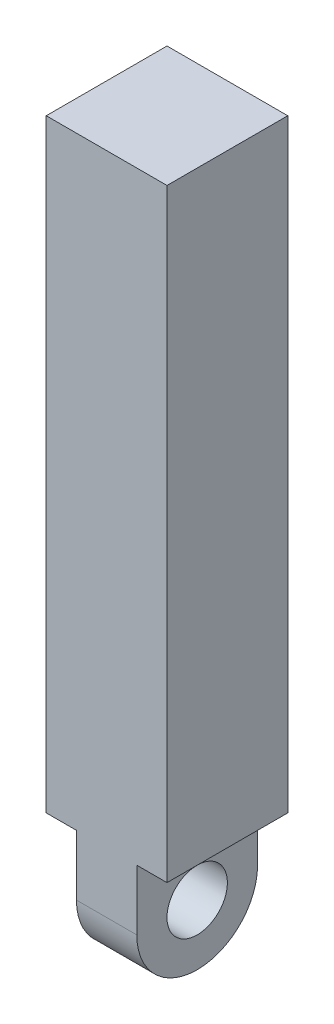
ISO-10303-21;
HEADER;
FILE_DESCRIPTION(('STEP AP214'),'2;1');
FILE_NAME('part.step','',(''),(''),'','','');
FILE_SCHEMA(('AUTOMOTIVE_DESIGN { 1 0 10303 214 1 1 1 1 }'));
ENDSEC;
DATA;
#1=APPLICATION_CONTEXT('core data for automotive mechanical design processes');
#2=APPLICATION_PROTOCOL_DEFINITION('international standard','automotive_design',2000,#1);
#3=PRODUCT_CONTEXT('',#1,'mechanical');
#4=PRODUCT('Part','Part','',(#3));
#5=PRODUCT_RELATED_PRODUCT_CATEGORY('part','',(#4));
#6=PRODUCT_DEFINITION_FORMATION('','',#4);
#7=PRODUCT_DEFINITION_CONTEXT('part definition',#1,'design');
#8=PRODUCT_DEFINITION('design','',#6,#7);
#9=PRODUCT_DEFINITION_SHAPE('','',#8);
#10=(LENGTH_UNIT() NAMED_UNIT(*) SI_UNIT(.MILLI.,.METRE.));
#11=(NAMED_UNIT(*) PLANE_ANGLE_UNIT() SI_UNIT($,.RADIAN.));
#12=(NAMED_UNIT(*) SI_UNIT($,.STERADIAN.) SOLID_ANGLE_UNIT());
#13=UNCERTAINTY_MEASURE_WITH_UNIT(LENGTH_MEASURE(1.E-05),#10,'distance_accuracy_value','');
#14=(GEOMETRIC_REPRESENTATION_CONTEXT(3) GLOBAL_UNCERTAINTY_ASSIGNED_CONTEXT((#13)) GLOBAL_UNIT_ASSIGNED_CONTEXT((#10,
#11,#12)) REPRESENTATION_CONTEXT('',''));
#15=CARTESIAN_POINT('',(0.,0.,0.));
#16=DIRECTION('',(0.,0.,1.));
#17=DIRECTION('',(1.,0.,0.));
#18=AXIS2_PLACEMENT_3D('',#15,#16,#17);
#19=CARTESIAN_POINT('',(50.8,609.6,50.8));
#20=DIRECTION('',(-1.,0.,0.));
#21=DIRECTION('',(0.,0.,1.));
#22=AXIS2_PLACEMENT_3D('',#19,#20,#21);
#23=PLANE('',#22);
#24=DIRECTION('',(0.,-1.,0.));
#25=VECTOR('',#24,1.);
#26=CARTESIAN_POINT('',(50.8,609.6,50.8));
#27=LINE('',#26,#25);
#28=CARTESIAN_POINT('',(50.8,609.6,50.8));
#29=VERTEX_POINT('',#28);
#30=CARTESIAN_POINT('',(50.8,101.6,50.8));
#31=VERTEX_POINT('',#30);
#32=EDGE_CURVE('E164',#29,#31,#27,.T.);
#33=ORIENTED_EDGE('',*,*,#32,.T.);
#34=DIRECTION('',(0.,0.,1.));
#35=VECTOR('',#34,1.);
#36=CARTESIAN_POINT('',(50.8,101.6,-50.8));
#37=LINE('',#36,#35);
#38=CARTESIAN_POINT('',(50.8,101.6,-50.8));
#39=VERTEX_POINT('',#38);
#40=EDGE_CURVE('E143',#39,#31,#37,.T.);
#41=ORIENTED_EDGE('',*,*,#40,.F.);
#42=DIRECTION('',(0.,-1.,0.));
#43=VECTOR('',#42,1.);
#44=CARTESIAN_POINT('',(50.8,609.6,-50.8));
#45=LINE('',#44,#43);
#46=CARTESIAN_POINT('',(50.8,609.6,-50.8));
#47=VERTEX_POINT('',#46);
#48=EDGE_CURVE('E172',#47,#39,#45,.T.);
#49=ORIENTED_EDGE('',*,*,#48,.F.);
#50=DIRECTION('',(0.,0.,-1.));
#51=VECTOR('',#50,1.);
#52=CARTESIAN_POINT('',(50.8,609.6,50.8));
#53=LINE('',#52,#51);
#54=EDGE_CURVE('E141',#29,#47,#53,.T.);
#55=ORIENTED_EDGE('',*,*,#54,.F.);
#56=EDGE_LOOP('',(#33,#41,#49,#55));
#57=FACE_BOUND('',#56,.T.);
#58=ADVANCED_FACE('F39',(#57),#23,.F.);
#59=CARTESIAN_POINT('',(-50.8,609.6,-50.8));
#60=DIRECTION('',(0.,0.,1.));
#61=DIRECTION('',(1.,0.,0.));
#62=AXIS2_PLACEMENT_3D('',#59,#60,#61);
#63=PLANE('',#62);
#64=DIRECTION('',(0.,-1.,0.));
#65=VECTOR('',#64,1.);
#66=CARTESIAN_POINT('',(25.4,0.,-50.8));
#67=LINE('',#66,#65);
#68=CARTESIAN_POINT('',(25.4,101.6,-50.8));
#69=VERTEX_POINT('',#68);
#70=CARTESIAN_POINT('',(25.4,50.8,-50.8));
#71=VERTEX_POINT('',#70);
#72=EDGE_CURVE('E145',#69,#71,#67,.T.);
#73=ORIENTED_EDGE('',*,*,#72,.T.);
#74=DIRECTION('',(-1.,0.,0.));
#75=VECTOR('',#74,1.);
#76=CARTESIAN_POINT('',(-25.4,50.8,-50.8));
#77=LINE('',#76,#75);
#78=CARTESIAN_POINT('',(-25.4,50.8,-50.8));
#79=VERTEX_POINT('',#78);
#80=EDGE_CURVE('E121',#71,#79,#77,.T.);
#81=ORIENTED_EDGE('',*,*,#80,.T.);
#82=DIRECTION('',(0.,1.,0.));
#83=VECTOR('',#82,1.);
#84=CARTESIAN_POINT('',(-25.4,0.,-50.8));
#85=LINE('',#84,#83);
#86=CARTESIAN_POINT('',(-25.4,101.6,-50.8));
#87=VERTEX_POINT('',#86);
#88=EDGE_CURVE('E112',#79,#87,#85,.T.);
#89=ORIENTED_EDGE('',*,*,#88,.T.);
#90=DIRECTION('',(-1.,0.,0.));
#91=VECTOR('',#90,1.);
#92=CARTESIAN_POINT('',(-50.8,101.6,-50.8));
#93=LINE('',#92,#91);
#94=CARTESIAN_POINT('',(-50.8,101.6,-50.8));
#95=VERTEX_POINT('',#94);
#96=EDGE_CURVE('E118',#87,#95,#93,.T.);
#97=ORIENTED_EDGE('',*,*,#96,.T.);
#98=DIRECTION('',(0.,-1.,0.));
#99=VECTOR('',#98,1.);
#100=CARTESIAN_POINT('',(-50.8,609.6,-50.8));
#101=LINE('',#100,#99);
#102=CARTESIAN_POINT('',(-50.8,609.6,-50.8));
#103=VERTEX_POINT('',#102);
#104=EDGE_CURVE('E170',#103,#95,#101,.T.);
#105=ORIENTED_EDGE('',*,*,#104,.F.);
#106=DIRECTION('',(-1.,0.,0.));
#107=VECTOR('',#106,1.);
#108=CARTESIAN_POINT('',(-50.8,609.6,-50.8));
#109=LINE('',#108,#107);
#110=EDGE_CURVE('E158',#47,#103,#109,.T.);
#111=ORIENTED_EDGE('',*,*,#110,.F.);
#112=ORIENTED_EDGE('',*,*,#48,.T.);
#113=DIRECTION('',(-1.,0.,0.));
#114=VECTOR('',#113,1.);
#115=CARTESIAN_POINT('',(50.8,101.6,-50.8));
#116=LINE('',#115,#114);
#117=EDGE_CURVE('E150',#39,#69,#116,.T.);
#118=ORIENTED_EDGE('',*,*,#117,.T.);
#119=EDGE_LOOP('',(#73,#81,#89,#97,#105,#111,#112,#118));
#120=FACE_BOUND('',#119,.T.);
#121=ADVANCED_FACE('F115',(#120),#63,.F.);
#122=CARTESIAN_POINT('',(-50.8,609.6,50.8));
#123=DIRECTION('',(1.,0.,0.));
#124=DIRECTION('',(0.,0.,-1.));
#125=AXIS2_PLACEMENT_3D('',#122,#123,#124);
#126=PLANE('',#125);
#127=ORIENTED_EDGE('',*,*,#104,.T.);
#128=DIRECTION('',(0.,0.,1.));
#129=VECTOR('',#128,1.);
#130=CARTESIAN_POINT('',(-50.8,101.6,-50.8));
#131=LINE('',#130,#129);
#132=CARTESIAN_POINT('',(-50.8,101.6,50.8));
#133=VERTEX_POINT('',#132);
#134=EDGE_CURVE('E131',#95,#133,#131,.T.);
#135=ORIENTED_EDGE('',*,*,#134,.T.);
#136=DIRECTION('',(0.,-1.,0.));
#137=VECTOR('',#136,1.);
#138=CARTESIAN_POINT('',(-50.8,609.6,50.8));
#139=LINE('',#138,#137);
#140=CARTESIAN_POINT('',(-50.8,609.6,50.8));
#141=VERTEX_POINT('',#140);
#142=EDGE_CURVE('E167',#141,#133,#139,.T.);
#143=ORIENTED_EDGE('',*,*,#142,.F.);
#144=DIRECTION('',(0.,0.,1.));
#145=VECTOR('',#144,1.);
#146=CARTESIAN_POINT('',(-50.8,609.6,50.8));
#147=LINE('',#146,#145);
#148=EDGE_CURVE('E160',#103,#141,#147,.T.);
#149=ORIENTED_EDGE('',*,*,#148,.F.);
#150=EDGE_LOOP('',(#127,#135,#143,#149));
#151=FACE_BOUND('',#150,.T.);
#152=ADVANCED_FACE('F216',(#151),#126,.F.);
#153=CARTESIAN_POINT('',(-50.8,609.6,50.8));
#154=DIRECTION('',(0.,0.,-1.));
#155=DIRECTION('',(-1.,0.,0.));
#156=AXIS2_PLACEMENT_3D('',#153,#154,#155);
#157=PLANE('',#156);
#158=DIRECTION('',(0.,1.,0.));
#159=VECTOR('',#158,1.);
#160=CARTESIAN_POINT('',(-25.4,0.,50.8));
#161=LINE('',#160,#159);
#162=CARTESIAN_POINT('',(-25.4,50.8,50.8));
#163=VERTEX_POINT('',#162);
#164=CARTESIAN_POINT('',(-25.4,101.6,50.8));
#165=VERTEX_POINT('',#164);
#166=EDGE_CURVE('E128',#163,#165,#161,.T.);
#167=ORIENTED_EDGE('',*,*,#166,.F.);
#168=DIRECTION('',(1.,0.,0.));
#169=VECTOR('',#168,1.);
#170=CARTESIAN_POINT('',(25.4,50.8,50.8));
#171=LINE('',#170,#169);
#172=CARTESIAN_POINT('',(25.4,50.8,50.8));
#173=VERTEX_POINT('',#172);
#174=EDGE_CURVE('E11',#163,#173,#171,.T.);
#175=ORIENTED_EDGE('',*,*,#174,.T.);
#176=DIRECTION('',(0.,-1.,0.));
#177=VECTOR('',#176,1.);
#178=CARTESIAN_POINT('',(25.4,0.,50.8));
#179=LINE('',#178,#177);
#180=CARTESIAN_POINT('',(25.4,101.6,50.8));
#181=VERTEX_POINT('',#180);
#182=EDGE_CURVE('E148',#181,#173,#179,.T.);
#183=ORIENTED_EDGE('',*,*,#182,.F.);
#184=DIRECTION('',(-1.,0.,0.));
#185=VECTOR('',#184,1.);
#186=CARTESIAN_POINT('',(50.8,101.6,50.8));
#187=LINE('',#186,#185);
#188=EDGE_CURVE('E139',#31,#181,#187,.T.);
#189=ORIENTED_EDGE('',*,*,#188,.F.);
#190=ORIENTED_EDGE('',*,*,#32,.F.);
#191=DIRECTION('',(1.,0.,0.));
#192=VECTOR('',#191,1.);
#193=CARTESIAN_POINT('',(-50.8,609.6,50.8));
#194=LINE('',#193,#192);
#195=EDGE_CURVE('E162',#141,#29,#194,.T.);
#196=ORIENTED_EDGE('',*,*,#195,.F.);
#197=ORIENTED_EDGE('',*,*,#142,.T.);
#198=DIRECTION('',(-1.,0.,0.));
#199=VECTOR('',#198,1.);
#200=CARTESIAN_POINT('',(-50.8,101.6,50.8));
#201=LINE('',#200,#199);
#202=EDGE_CURVE('E123',#165,#133,#201,.T.);
#203=ORIENTED_EDGE('',*,*,#202,.F.);
#204=EDGE_LOOP('',(#167,#175,#183,#189,#190,#196,#197,#203));
#205=FACE_BOUND('',#204,.T.);
#206=ADVANCED_FACE('F264',(#205),#157,.F.);
#207=CARTESIAN_POINT('',(0.,609.6,0.));
#208=DIRECTION('',(0.,-1.,0.));
#209=DIRECTION('',(0.,0.,-1.));
#210=AXIS2_PLACEMENT_3D('',#207,#208,#209);
#211=PLANE('',#210);
#212=ORIENTED_EDGE('',*,*,#54,.T.);
#213=ORIENTED_EDGE('',*,*,#110,.T.);
#214=ORIENTED_EDGE('',*,*,#148,.T.);
#215=ORIENTED_EDGE('',*,*,#195,.T.);
#216=EDGE_LOOP('',(#212,#213,#214,#215));
#217=FACE_BOUND('',#216,.T.);
#218=ADVANCED_FACE('F243',(#217),#211,.F.);
#219=CARTESIAN_POINT('',(25.4,0.,-50.8));
#220=DIRECTION('',(-1.,0.,0.));
#221=DIRECTION('',(0.,0.,1.));
#222=AXIS2_PLACEMENT_3D('',#219,#220,#221);
#223=PLANE('',#222);
#224=CARTESIAN_POINT('',(25.4,50.8,0.));
#225=DIRECTION('',(-1.,0.,0.));
#226=DIRECTION('',(0.,0.,1.));
#227=AXIS2_PLACEMENT_3D('',#224,#225,#226);
#228=CIRCLE('',#227,25.4);
#229=CARTESIAN_POINT('',(25.4,50.8,25.4));
#230=VERTEX_POINT('',#229);
#231=EDGE_CURVE('E189',#230,#230,#228,.T.);
#232=ORIENTED_EDGE('',*,*,#231,.T.);
#233=EDGE_LOOP('',(#232));
#234=FACE_BOUND('',#233,.T.);
#235=CARTESIAN_POINT('',(25.4,50.8,0.));
#236=DIRECTION('',(-1.,0.,0.));
#237=DIRECTION('',(0.,0.,1.));
#238=AXIS2_PLACEMENT_3D('',#235,#236,#237);
#239=CIRCLE('',#238,50.8);
#240=CARTESIAN_POINT('',(25.4,0.,0.));
#241=VERTEX_POINT('',#240);
#242=EDGE_CURVE('E55',#173,#241,#239,.F.);
#243=ORIENTED_EDGE('',*,*,#242,.T.);
#244=CARTESIAN_POINT('',(25.4,50.8,0.));
#245=DIRECTION('',(-1.,0.,0.));
#246=DIRECTION('',(0.,0.,1.));
#247=AXIS2_PLACEMENT_3D('',#244,#245,#246);
#248=CIRCLE('',#247,50.8);
#249=EDGE_CURVE('E48',#241,#71,#248,.F.);
#250=ORIENTED_EDGE('',*,*,#249,.T.);
#251=ORIENTED_EDGE('',*,*,#72,.F.);
#252=DIRECTION('',(0.,0.,1.));
#253=VECTOR('',#252,1.);
#254=CARTESIAN_POINT('',(25.4,101.6,-50.8));
#255=LINE('',#254,#253);
#256=EDGE_CURVE('E146',#69,#181,#255,.T.);
#257=ORIENTED_EDGE('',*,*,#256,.T.);
#258=ORIENTED_EDGE('',*,*,#182,.T.);
#259=EDGE_LOOP('',(#243,#250,#251,#257,#258));
#260=FACE_BOUND('',#259,.T.);
#261=ADVANCED_FACE('F183',(#234,#260),#223,.F.);
#262=CARTESIAN_POINT('',(50.8,101.6,-50.8));
#263=DIRECTION('',(0.,1.,0.));
#264=DIRECTION('',(0.,0.,1.));
#265=AXIS2_PLACEMENT_3D('',#262,#263,#264);
#266=PLANE('',#265);
#267=ORIENTED_EDGE('',*,*,#188,.T.);
#268=ORIENTED_EDGE('',*,*,#256,.F.);
#269=ORIENTED_EDGE('',*,*,#117,.F.);
#270=ORIENTED_EDGE('',*,*,#40,.T.);
#271=EDGE_LOOP('',(#267,#268,#269,#270));
#272=FACE_BOUND('',#271,.T.);
#273=ADVANCED_FACE('F207',(#272),#266,.F.);
#274=CARTESIAN_POINT('',(-50.8,101.6,-50.8));
#275=DIRECTION('',(0.,1.,0.));
#276=DIRECTION('',(0.,0.,1.));
#277=AXIS2_PLACEMENT_3D('',#274,#275,#276);
#278=PLANE('',#277);
#279=ORIENTED_EDGE('',*,*,#202,.T.);
#280=ORIENTED_EDGE('',*,*,#134,.F.);
#281=ORIENTED_EDGE('',*,*,#96,.F.);
#282=DIRECTION('',(0.,0.,1.));
#283=VECTOR('',#282,1.);
#284=CARTESIAN_POINT('',(-25.4,101.6,-50.8));
#285=LINE('',#284,#283);
#286=EDGE_CURVE('E126',#87,#165,#285,.T.);
#287=ORIENTED_EDGE('',*,*,#286,.T.);
#288=EDGE_LOOP('',(#279,#280,#281,#287));
#289=FACE_BOUND('',#288,.T.);
#290=ADVANCED_FACE('F133',(#289),#278,.F.);
#291=CARTESIAN_POINT('',(-25.4,0.,-50.8));
#292=DIRECTION('',(1.,0.,0.));
#293=DIRECTION('',(0.,0.,-1.));
#294=AXIS2_PLACEMENT_3D('',#291,#292,#293);
#295=PLANE('',#294);
#296=CARTESIAN_POINT('',(-25.4,50.8,0.));
#297=DIRECTION('',(-1.,0.,0.));
#298=DIRECTION('',(0.,0.,1.));
#299=AXIS2_PLACEMENT_3D('',#296,#297,#298);
#300=CIRCLE('',#299,25.4);
#301=CARTESIAN_POINT('',(-25.4,50.8,25.4));
#302=VERTEX_POINT('',#301);
#303=EDGE_CURVE('E191',#302,#302,#300,.T.);
#304=ORIENTED_EDGE('',*,*,#303,.F.);
#305=EDGE_LOOP('',(#304));
#306=FACE_BOUND('',#305,.T.);
#307=ORIENTED_EDGE('',*,*,#88,.F.);
#308=CARTESIAN_POINT('',(-25.4,50.8,0.));
#309=DIRECTION('',(1.,0.,0.));
#310=DIRECTION('',(0.,0.,-1.));
#311=AXIS2_PLACEMENT_3D('',#308,#309,#310);
#312=CIRCLE('',#311,50.8);
#313=CARTESIAN_POINT('',(-25.4,0.,0.));
#314=VERTEX_POINT('',#313);
#315=EDGE_CURVE('E178',#79,#314,#312,.F.);
#316=ORIENTED_EDGE('',*,*,#315,.T.);
#317=CARTESIAN_POINT('',(-25.4,50.8,0.));
#318=DIRECTION('',(1.,0.,0.));
#319=DIRECTION('',(0.,0.,-1.));
#320=AXIS2_PLACEMENT_3D('',#317,#318,#319);
#321=CIRCLE('',#320,50.8);
#322=EDGE_CURVE('E176',#314,#163,#321,.F.);
#323=ORIENTED_EDGE('',*,*,#322,.T.);
#324=ORIENTED_EDGE('',*,*,#166,.T.);
#325=ORIENTED_EDGE('',*,*,#286,.F.);
#326=EDGE_LOOP('',(#307,#316,#323,#324,#325));
#327=FACE_BOUND('',#326,.T.);
#328=ADVANCED_FACE('F127',(#306,#327),#295,.F.);
#329=CARTESIAN_POINT('',(-50.8,50.8,0.));
#330=DIRECTION('',(-1.,0.,0.));
#331=DIRECTION('',(0.,0.,1.));
#332=AXIS2_PLACEMENT_3D('',#329,#330,#331);
#333=CYLINDRICAL_SURFACE('',#332,50.8);
#334=DIRECTION('',(1.,0.,0.));
#335=VECTOR('',#334,1.);
#336=CARTESIAN_POINT('',(-25.4,0.,0.));
#337=LINE('',#336,#335);
#338=EDGE_CURVE('E43',#241,#314,#337,.F.);
#339=ORIENTED_EDGE('',*,*,#338,.F.);
#340=ORIENTED_EDGE('',*,*,#242,.F.);
#341=ORIENTED_EDGE('',*,*,#174,.F.);
#342=ORIENTED_EDGE('',*,*,#322,.F.);
#343=EDGE_LOOP('',(#339,#340,#341,#342));
#344=FACE_BOUND('',#343,.T.);
#345=ADVANCED_FACE('F41',(#344),#333,.T.);
#346=CARTESIAN_POINT('',(-50.8,50.8,0.));
#347=DIRECTION('',(1.,0.,0.));
#348=DIRECTION('',(0.,0.,-1.));
#349=AXIS2_PLACEMENT_3D('',#346,#347,#348);
#350=CYLINDRICAL_SURFACE('',#349,50.8);
#351=ORIENTED_EDGE('',*,*,#249,.F.);
#352=ORIENTED_EDGE('',*,*,#338,.T.);
#353=ORIENTED_EDGE('',*,*,#315,.F.);
#354=ORIENTED_EDGE('',*,*,#80,.F.);
#355=EDGE_LOOP('',(#351,#352,#353,#354));
#356=FACE_BOUND('',#355,.T.);
#357=ADVANCED_FACE('F186',(#356),#350,.T.);
#358=CARTESIAN_POINT('',(50.8,50.8,0.));
#359=DIRECTION('',(-1.,0.,0.));
#360=DIRECTION('',(0.,0.,1.));
#361=AXIS2_PLACEMENT_3D('',#358,#359,#360);
#362=CYLINDRICAL_SURFACE('',#361,25.4);
#363=ORIENTED_EDGE('',*,*,#303,.T.);
#364=EDGE_LOOP('',(#363));
#365=FACE_BOUND('',#364,.T.);
#366=ORIENTED_EDGE('',*,*,#231,.F.);
#367=EDGE_LOOP('',(#366));
#368=FACE_BOUND('',#367,.T.);
#369=ADVANCED_FACE('F198',(#365,#368),#362,.F.);
#370=CLOSED_SHELL('',(#58,#121,#152,#206,#218,#261,#273,#290,#328,#345,#357,#369));
#371=MANIFOLD_SOLID_BREP('B2',#370);
#372=ADVANCED_BREP_SHAPE_REPRESENTATION('',(#18,#371),#14);
#373=SHAPE_DEFINITION_REPRESENTATION(#9,#372);
ENDSEC;
END-ISO-10303-21;
